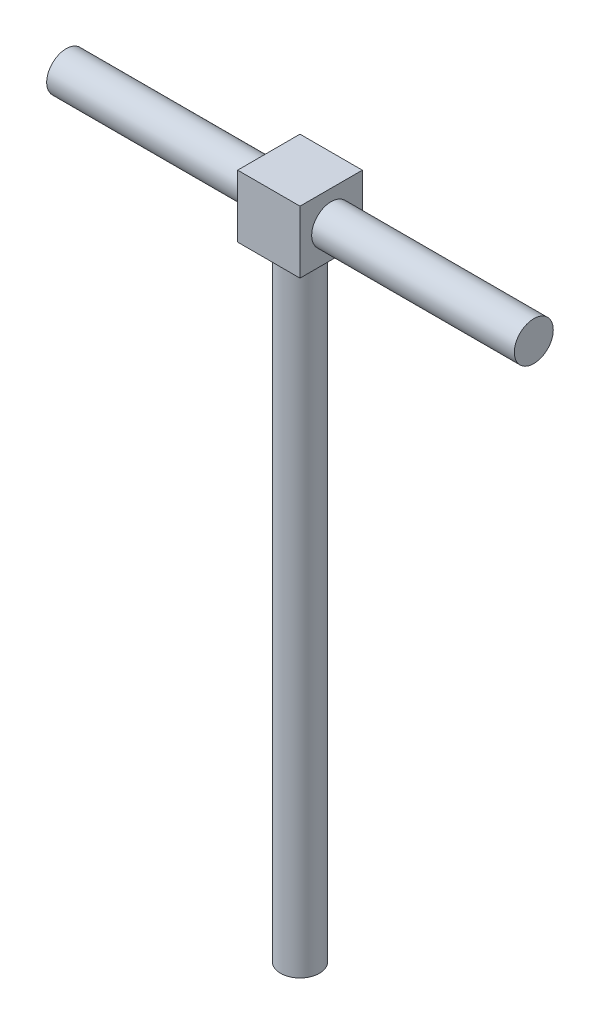
ISO-10303-21;
HEADER;
FILE_DESCRIPTION(('STEP AP214'),'2;1');
FILE_NAME('part.step','',(''),(''),'','','');
FILE_SCHEMA(('AUTOMOTIVE_DESIGN { 1 0 10303 214 1 1 1 1 }'));
ENDSEC;
DATA;
#1=APPLICATION_CONTEXT('core data for automotive mechanical design processes');
#2=APPLICATION_PROTOCOL_DEFINITION('international standard','automotive_design',2000,#1);
#3=PRODUCT_CONTEXT('',#1,'mechanical');
#4=PRODUCT('Part','Part','',(#3));
#5=PRODUCT_RELATED_PRODUCT_CATEGORY('part','',(#4));
#6=PRODUCT_DEFINITION_FORMATION('','',#4);
#7=PRODUCT_DEFINITION_CONTEXT('part definition',#1,'design');
#8=PRODUCT_DEFINITION('design','',#6,#7);
#9=PRODUCT_DEFINITION_SHAPE('','',#8);
#10=(LENGTH_UNIT() NAMED_UNIT(*) SI_UNIT(.MILLI.,.METRE.));
#11=(NAMED_UNIT(*) PLANE_ANGLE_UNIT() SI_UNIT($,.RADIAN.));
#12=(NAMED_UNIT(*) SI_UNIT($,.STERADIAN.) SOLID_ANGLE_UNIT());
#13=UNCERTAINTY_MEASURE_WITH_UNIT(LENGTH_MEASURE(1.E-05),#10,'distance_accuracy_value','');
#14=(GEOMETRIC_REPRESENTATION_CONTEXT(3) GLOBAL_UNCERTAINTY_ASSIGNED_CONTEXT((#13)) GLOBAL_UNIT_ASSIGNED_CONTEXT((#10,
#11,#12)) REPRESENTATION_CONTEXT('',''));
#15=CARTESIAN_POINT('',(0.,0.,0.));
#16=DIRECTION('',(0.,0.,1.));
#17=DIRECTION('',(1.,0.,0.));
#18=AXIS2_PLACEMENT_3D('',#15,#16,#17);
#19=CARTESIAN_POINT('',(0.,80.,0.));
#20=DIRECTION('',(0.,-1.,0.));
#21=DIRECTION('',(0.,0.,-1.));
#22=AXIS2_PLACEMENT_3D('',#19,#20,#21);
#23=CYLINDRICAL_SURFACE('',#22,2.5);
#24=CARTESIAN_POINT('',(0.,80.,0.));
#25=DIRECTION('',(0.,1.,0.));
#26=DIRECTION('',(0.,0.,1.));
#27=AXIS2_PLACEMENT_3D('',#24,#25,#26);
#28=CIRCLE('',#27,2.5);
#29=CARTESIAN_POINT('',(0.,80.,2.5));
#30=VERTEX_POINT('',#29);
#31=EDGE_CURVE('E134',#30,#30,#28,.T.);
#32=ORIENTED_EDGE('',*,*,#31,.F.);
#33=EDGE_LOOP('',(#32));
#34=FACE_BOUND('',#33,.T.);
#35=CARTESIAN_POINT('',(0.,0.,0.));
#36=DIRECTION('',(0.,1.,0.));
#37=DIRECTION('',(0.,0.,1.));
#38=AXIS2_PLACEMENT_3D('',#35,#36,#37);
#39=CIRCLE('',#38,2.5);
#40=CARTESIAN_POINT('',(0.,0.,2.5));
#41=VERTEX_POINT('',#40);
#42=EDGE_CURVE('E133',#41,#41,#39,.T.);
#43=ORIENTED_EDGE('',*,*,#42,.T.);
#44=EDGE_LOOP('',(#43));
#45=FACE_BOUND('',#44,.T.);
#46=ADVANCED_FACE('F43',(#34,#45),#23,.T.);
#47=CARTESIAN_POINT('',(0.,0.,0.));
#48=DIRECTION('',(0.,1.,0.));
#49=DIRECTION('',(0.,0.,1.));
#50=AXIS2_PLACEMENT_3D('',#47,#48,#49);
#51=PLANE('',#50);
#52=ORIENTED_EDGE('',*,*,#42,.F.);
#53=EDGE_LOOP('',(#52));
#54=FACE_BOUND('',#53,.T.);
#55=ADVANCED_FACE('F142',(#54),#51,.F.);
#56=CARTESIAN_POINT('',(4.,88.,4.));
#57=DIRECTION('',(-1.,0.,0.));
#58=DIRECTION('',(0.,0.,1.));
#59=AXIS2_PLACEMENT_3D('',#56,#57,#58);
#60=PLANE('',#59);
#61=CARTESIAN_POINT('',(4.,84.,0.));
#62=DIRECTION('',(-1.,0.,0.));
#63=DIRECTION('',(0.,0.,1.));
#64=AXIS2_PLACEMENT_3D('',#61,#62,#63);
#65=CIRCLE('',#64,2.5);
#66=CARTESIAN_POINT('',(4.,84.,2.5));
#67=VERTEX_POINT('',#66);
#68=EDGE_CURVE('E11',#67,#67,#65,.F.);
#69=ORIENTED_EDGE('',*,*,#68,.F.);
#70=EDGE_LOOP('',(#69));
#71=FACE_BOUND('',#70,.T.);
#72=DIRECTION('',(0.,0.,-1.));
#73=VECTOR('',#72,1.);
#74=CARTESIAN_POINT('',(4.,80.,4.));
#75=LINE('',#74,#73);
#76=CARTESIAN_POINT('',(4.,80.,4.));
#77=VERTEX_POINT('',#76);
#78=CARTESIAN_POINT('',(4.,80.,-4.));
#79=VERTEX_POINT('',#78);
#80=EDGE_CURVE('E116',#77,#79,#75,.T.);
#81=ORIENTED_EDGE('',*,*,#80,.T.);
#82=DIRECTION('',(0.,-1.,0.));
#83=VECTOR('',#82,1.);
#84=CARTESIAN_POINT('',(4.,88.,-4.));
#85=LINE('',#84,#83);
#86=CARTESIAN_POINT('',(4.,88.,-4.));
#87=VERTEX_POINT('',#86);
#88=EDGE_CURVE('E105',#87,#79,#85,.T.);
#89=ORIENTED_EDGE('',*,*,#88,.F.);
#90=DIRECTION('',(0.,0.,-1.));
#91=VECTOR('',#90,1.);
#92=CARTESIAN_POINT('',(4.,88.,4.));
#93=LINE('',#92,#91);
#94=CARTESIAN_POINT('',(4.,88.,4.));
#95=VERTEX_POINT('',#94);
#96=EDGE_CURVE('E97',#95,#87,#93,.T.);
#97=ORIENTED_EDGE('',*,*,#96,.F.);
#98=DIRECTION('',(0.,-1.,0.));
#99=VECTOR('',#98,1.);
#100=CARTESIAN_POINT('',(4.,88.,4.));
#101=LINE('',#100,#99);
#102=EDGE_CURVE('E112',#95,#77,#101,.T.);
#103=ORIENTED_EDGE('',*,*,#102,.T.);
#104=EDGE_LOOP('',(#81,#89,#97,#103));
#105=FACE_BOUND('',#104,.T.);
#106=ADVANCED_FACE('F144',(#71,#105),#60,.F.);
#107=CARTESIAN_POINT('',(-4.,88.,-4.));
#108=DIRECTION('',(0.,0.,1.));
#109=DIRECTION('',(1.,0.,0.));
#110=AXIS2_PLACEMENT_3D('',#107,#108,#109);
#111=PLANE('',#110);
#112=DIRECTION('',(-1.,0.,0.));
#113=VECTOR('',#112,1.);
#114=CARTESIAN_POINT('',(-4.,80.,-4.));
#115=LINE('',#114,#113);
#116=CARTESIAN_POINT('',(-4.,80.,-4.));
#117=VERTEX_POINT('',#116);
#118=EDGE_CURVE('E103',#79,#117,#115,.T.);
#119=ORIENTED_EDGE('',*,*,#118,.T.);
#120=DIRECTION('',(0.,-1.,0.));
#121=VECTOR('',#120,1.);
#122=CARTESIAN_POINT('',(-4.,88.,-4.));
#123=LINE('',#122,#121);
#124=CARTESIAN_POINT('',(-4.,88.,-4.));
#125=VERTEX_POINT('',#124);
#126=EDGE_CURVE('E101',#125,#117,#123,.T.);
#127=ORIENTED_EDGE('',*,*,#126,.F.);
#128=DIRECTION('',(-1.,0.,0.));
#129=VECTOR('',#128,1.);
#130=CARTESIAN_POINT('',(-4.,88.,-4.));
#131=LINE('',#130,#129);
#132=EDGE_CURVE('E92',#87,#125,#131,.T.);
#133=ORIENTED_EDGE('',*,*,#132,.F.);
#134=ORIENTED_EDGE('',*,*,#88,.T.);
#135=EDGE_LOOP('',(#119,#127,#133,#134));
#136=FACE_BOUND('',#135,.T.);
#137=ADVANCED_FACE('F102',(#136),#111,.F.);
#138=CARTESIAN_POINT('',(-4.,88.,4.));
#139=DIRECTION('',(1.,0.,0.));
#140=DIRECTION('',(0.,0.,-1.));
#141=AXIS2_PLACEMENT_3D('',#138,#139,#140);
#142=PLANE('',#141);
#143=CARTESIAN_POINT('',(-4.,84.,0.));
#144=DIRECTION('',(1.,0.,0.));
#145=DIRECTION('',(0.,0.,-1.));
#146=AXIS2_PLACEMENT_3D('',#143,#144,#145);
#147=CIRCLE('',#146,2.5);
#148=CARTESIAN_POINT('',(-4.,84.,-2.5));
#149=VERTEX_POINT('',#148);
#150=EDGE_CURVE('E46',#149,#149,#147,.F.);
#151=ORIENTED_EDGE('',*,*,#150,.F.);
#152=EDGE_LOOP('',(#151));
#153=FACE_BOUND('',#152,.T.);
#154=DIRECTION('',(0.,0.,1.));
#155=VECTOR('',#154,1.);
#156=CARTESIAN_POINT('',(-4.,80.,4.));
#157=LINE('',#156,#155);
#158=CARTESIAN_POINT('',(-4.,80.,4.));
#159=VERTEX_POINT('',#158);
#160=EDGE_CURVE('E78',#117,#159,#157,.T.);
#161=ORIENTED_EDGE('',*,*,#160,.T.);
#162=DIRECTION('',(0.,-1.,0.));
#163=VECTOR('',#162,1.);
#164=CARTESIAN_POINT('',(-4.,88.,4.));
#165=LINE('',#164,#163);
#166=CARTESIAN_POINT('',(-4.,88.,4.));
#167=VERTEX_POINT('',#166);
#168=EDGE_CURVE('E106',#167,#159,#165,.T.);
#169=ORIENTED_EDGE('',*,*,#168,.F.);
#170=DIRECTION('',(0.,0.,1.));
#171=VECTOR('',#170,1.);
#172=CARTESIAN_POINT('',(-4.,88.,4.));
#173=LINE('',#172,#171);
#174=EDGE_CURVE('E95',#125,#167,#173,.T.);
#175=ORIENTED_EDGE('',*,*,#174,.F.);
#176=ORIENTED_EDGE('',*,*,#126,.T.);
#177=EDGE_LOOP('',(#161,#169,#175,#176));
#178=FACE_BOUND('',#177,.T.);
#179=ADVANCED_FACE('F108',(#153,#178),#142,.F.);
#180=CARTESIAN_POINT('',(-4.,88.,4.));
#181=DIRECTION('',(0.,0.,-1.));
#182=DIRECTION('',(-1.,0.,0.));
#183=AXIS2_PLACEMENT_3D('',#180,#181,#182);
#184=PLANE('',#183);
#185=DIRECTION('',(1.,0.,0.));
#186=VECTOR('',#185,1.);
#187=CARTESIAN_POINT('',(-4.,80.,4.));
#188=LINE('',#187,#186);
#189=EDGE_CURVE('E84',#159,#77,#188,.T.);
#190=ORIENTED_EDGE('',*,*,#189,.T.);
#191=ORIENTED_EDGE('',*,*,#102,.F.);
#192=DIRECTION('',(1.,0.,0.));
#193=VECTOR('',#192,1.);
#194=CARTESIAN_POINT('',(-4.,88.,4.));
#195=LINE('',#194,#193);
#196=EDGE_CURVE('E61',#167,#95,#195,.T.);
#197=ORIENTED_EDGE('',*,*,#196,.F.);
#198=ORIENTED_EDGE('',*,*,#168,.T.);
#199=EDGE_LOOP('',(#190,#191,#197,#198));
#200=FACE_BOUND('',#199,.T.);
#201=ADVANCED_FACE('F157',(#200),#184,.F.);
#202=CARTESIAN_POINT('',(0.,88.,0.));
#203=DIRECTION('',(0.,-1.,0.));
#204=DIRECTION('',(0.,0.,-1.));
#205=AXIS2_PLACEMENT_3D('',#202,#203,#204);
#206=PLANE('',#205);
#207=ORIENTED_EDGE('',*,*,#96,.T.);
#208=ORIENTED_EDGE('',*,*,#132,.T.);
#209=ORIENTED_EDGE('',*,*,#174,.T.);
#210=ORIENTED_EDGE('',*,*,#196,.T.);
#211=EDGE_LOOP('',(#207,#208,#209,#210));
#212=FACE_BOUND('',#211,.T.);
#213=ADVANCED_FACE('F93',(#212),#206,.F.);
#214=CARTESIAN_POINT('',(0.,80.,0.));
#215=DIRECTION('',(0.,-1.,0.));
#216=DIRECTION('',(0.,0.,-1.));
#217=AXIS2_PLACEMENT_3D('',#214,#215,#216);
#218=PLANE('',#217);
#219=ORIENTED_EDGE('',*,*,#31,.T.);
#220=EDGE_LOOP('',(#219));
#221=FACE_BOUND('',#220,.T.);
#222=ORIENTED_EDGE('',*,*,#80,.F.);
#223=ORIENTED_EDGE('',*,*,#189,.F.);
#224=ORIENTED_EDGE('',*,*,#160,.F.);
#225=ORIENTED_EDGE('',*,*,#118,.F.);
#226=EDGE_LOOP('',(#222,#223,#224,#225));
#227=FACE_BOUND('',#226,.T.);
#228=ADVANCED_FACE('F161',(#221,#227),#218,.T.);
#229=CARTESIAN_POINT('',(-30.,84.,0.));
#230=DIRECTION('',(1.,0.,0.));
#231=DIRECTION('',(0.,0.,-1.));
#232=AXIS2_PLACEMENT_3D('',#229,#230,#231);
#233=PLANE('',#232);
#234=CARTESIAN_POINT('',(-30.,84.,0.));
#235=DIRECTION('',(1.,0.,0.));
#236=DIRECTION('',(0.,0.,-1.));
#237=AXIS2_PLACEMENT_3D('',#234,#235,#236);
#238=CIRCLE('',#237,2.5);
#239=CARTESIAN_POINT('',(-30.,84.,-2.5));
#240=VERTEX_POINT('',#239);
#241=EDGE_CURVE('E184',#240,#240,#238,.T.);
#242=ORIENTED_EDGE('',*,*,#241,.F.);
#243=EDGE_LOOP('',(#242));
#244=FACE_BOUND('',#243,.T.);
#245=ADVANCED_FACE('F164',(#244),#233,.F.);
#246=CARTESIAN_POINT('',(30.,84.,0.));
#247=DIRECTION('',(-1.,0.,0.));
#248=DIRECTION('',(0.,0.,1.));
#249=AXIS2_PLACEMENT_3D('',#246,#247,#248);
#250=CYLINDRICAL_SURFACE('',#249,2.5);
#251=ORIENTED_EDGE('',*,*,#241,.T.);
#252=EDGE_LOOP('',(#251));
#253=FACE_BOUND('',#252,.T.);
#254=ORIENTED_EDGE('',*,*,#150,.T.);
#255=EDGE_LOOP('',(#254));
#256=FACE_BOUND('',#255,.T.);
#257=ADVANCED_FACE('F172',(#253,#256),#250,.T.);
#258=CARTESIAN_POINT('',(30.,84.,0.));
#259=DIRECTION('',(1.,0.,0.));
#260=DIRECTION('',(0.,0.,-1.));
#261=AXIS2_PLACEMENT_3D('',#258,#259,#260);
#262=CIRCLE('',#261,2.5);
#263=CARTESIAN_POINT('',(30.,84.,-2.5));
#264=VERTEX_POINT('',#263);
#265=EDGE_CURVE('E120',#264,#264,#262,.T.);
#266=ORIENTED_EDGE('',*,*,#265,.F.);
#267=EDGE_LOOP('',(#266));
#268=FACE_BOUND('',#267,.T.);
#269=ORIENTED_EDGE('',*,*,#68,.T.);
#270=EDGE_LOOP('',(#269));
#271=FACE_BOUND('',#270,.T.);
#272=ADVANCED_FACE('F168',(#268,#271),#250,.T.);
#273=CARTESIAN_POINT('',(30.,84.,0.));
#274=DIRECTION('',(1.,0.,0.));
#275=DIRECTION('',(0.,0.,-1.));
#276=AXIS2_PLACEMENT_3D('',#273,#274,#275);
#277=PLANE('',#276);
#278=ORIENTED_EDGE('',*,*,#265,.T.);
#279=EDGE_LOOP('',(#278));
#280=FACE_BOUND('',#279,.T.);
#281=ADVANCED_FACE('F171',(#280),#277,.T.);
#282=CLOSED_SHELL('',(#46,#55,#106,#137,#179,#201,#213,#228,#245,#257,#272,#281));
#283=MANIFOLD_SOLID_BREP('B2',#282);
#284=ADVANCED_BREP_SHAPE_REPRESENTATION('',(#18,#283),#14);
#285=SHAPE_DEFINITION_REPRESENTATION(#9,#284);
ENDSEC;
END-ISO-10303-21;
